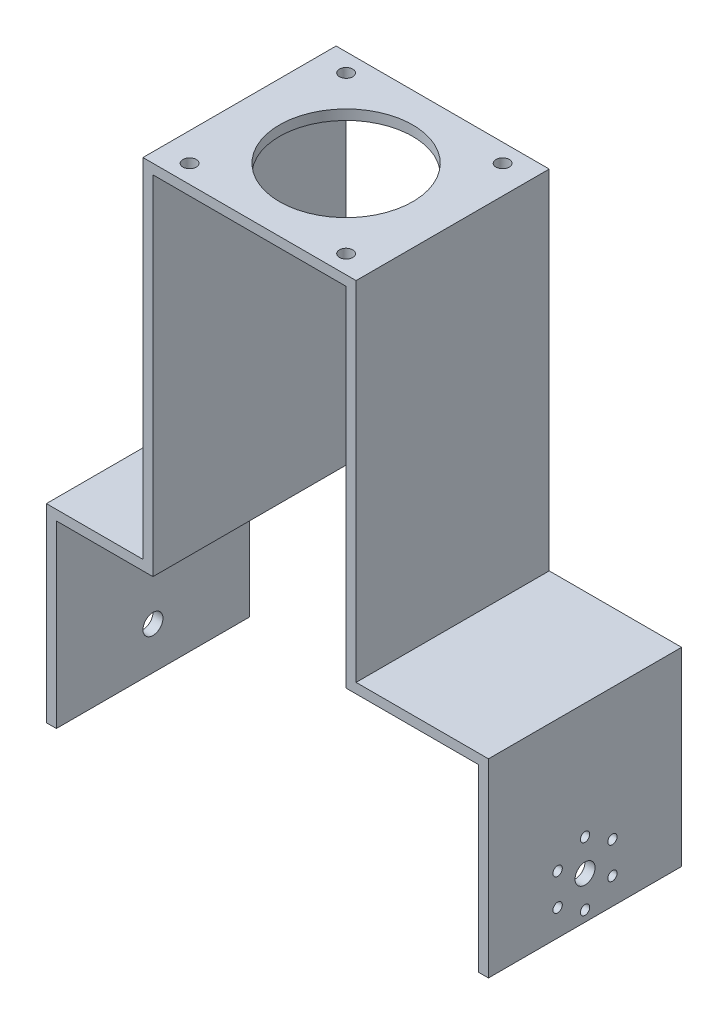
ISO-10303-21;
HEADER;
FILE_DESCRIPTION(('STEP AP214'),'2;1');
FILE_NAME('part.step','',(''),(''),'','','');
FILE_SCHEMA(('AUTOMOTIVE_DESIGN { 1 0 10303 214 1 1 1 1 }'));
ENDSEC;
DATA;
#1=APPLICATION_CONTEXT('core data for automotive mechanical design processes');
#2=APPLICATION_PROTOCOL_DEFINITION('international standard','automotive_design',2000,#1);
#3=PRODUCT_CONTEXT('',#1,'mechanical');
#4=PRODUCT('Part','Part','',(#3));
#5=PRODUCT_RELATED_PRODUCT_CATEGORY('part','',(#4));
#6=PRODUCT_DEFINITION_FORMATION('','',#4);
#7=PRODUCT_DEFINITION_CONTEXT('part definition',#1,'design');
#8=PRODUCT_DEFINITION('design','',#6,#7);
#9=PRODUCT_DEFINITION_SHAPE('','',#8);
#10=(LENGTH_UNIT() NAMED_UNIT(*) SI_UNIT(.MILLI.,.METRE.));
#11=(NAMED_UNIT(*) PLANE_ANGLE_UNIT() SI_UNIT($,.RADIAN.));
#12=(NAMED_UNIT(*) SI_UNIT($,.STERADIAN.) SOLID_ANGLE_UNIT());
#13=UNCERTAINTY_MEASURE_WITH_UNIT(LENGTH_MEASURE(1.E-05),#10,'distance_accuracy_value','');
#14=(GEOMETRIC_REPRESENTATION_CONTEXT(3) GLOBAL_UNCERTAINTY_ASSIGNED_CONTEXT((#13)) GLOBAL_UNIT_ASSIGNED_CONTEXT((#10,
#11,#12)) REPRESENTATION_CONTEXT('',''));
#15=CARTESIAN_POINT('',(0.,0.,0.));
#16=DIRECTION('',(0.,0.,1.));
#17=DIRECTION('',(1.,0.,0.));
#18=AXIS2_PLACEMENT_3D('',#15,#16,#17);
#19=CARTESIAN_POINT('',(-32.,51.8967154618484,58.));
#20=DIRECTION('',(1.,0.,0.));
#21=DIRECTION('',(0.,1.,0.));
#22=AXIS2_PLACEMENT_3D('',#19,#20,#21);
#23=PLANE('',#22);
#24=DIRECTION('',(0.,-1.,0.));
#25=VECTOR('',#24,1.);
#26=CARTESIAN_POINT('',(-32.,51.8967154618484,0.));
#27=LINE('',#26,#25);
#28=CARTESIAN_POINT('',(-32.,51.8967154618484,0.));
#29=VERTEX_POINT('',#28);
#30=CARTESIAN_POINT('',(-32.,-52.6032845381516,0.));
#31=VERTEX_POINT('',#30);
#32=EDGE_CURVE('E185',#29,#31,#27,.T.);
#33=ORIENTED_EDGE('',*,*,#32,.T.);
#34=DIRECTION('',(0.,0.,-1.));
#35=VECTOR('',#34,1.);
#36=CARTESIAN_POINT('',(-32.,-52.6032845381516,58.));
#37=LINE('',#36,#35);
#38=CARTESIAN_POINT('',(-32.,-52.6032845381516,58.));
#39=VERTEX_POINT('',#38);
#40=EDGE_CURVE('E45',#39,#31,#37,.T.);
#41=ORIENTED_EDGE('',*,*,#40,.F.);
#42=DIRECTION('',(0.,-1.,0.));
#43=VECTOR('',#42,1.);
#44=CARTESIAN_POINT('',(-32.,51.8967154618484,58.));
#45=LINE('',#44,#43);
#46=CARTESIAN_POINT('',(-32.,51.8967154618484,58.));
#47=VERTEX_POINT('',#46);
#48=EDGE_CURVE('E121',#47,#39,#45,.T.);
#49=ORIENTED_EDGE('',*,*,#48,.F.);
#50=DIRECTION('',(0.,0.,-1.));
#51=VECTOR('',#50,1.);
#52=CARTESIAN_POINT('',(-32.,51.8967154618484,58.));
#53=LINE('',#52,#51);
#54=EDGE_CURVE('E11',#47,#29,#53,.T.);
#55=ORIENTED_EDGE('',*,*,#54,.T.);
#56=EDGE_LOOP('',(#33,#41,#49,#55));
#57=FACE_BOUND('',#56,.T.);
#58=ADVANCED_FACE('F36',(#57),#23,.F.);
#59=CARTESIAN_POINT('',(-32.,-52.6032845381516,58.));
#60=DIRECTION('',(0.,-1.,0.));
#61=DIRECTION('',(1.,0.,0.));
#62=AXIS2_PLACEMENT_3D('',#59,#60,#61);
#63=PLANE('',#62);
#64=DIRECTION('',(-1.,0.,0.));
#65=VECTOR('',#64,1.);
#66=CARTESIAN_POINT('',(-32.,-52.6032845381516,0.));
#67=LINE('',#66,#65);
#68=CARTESIAN_POINT('',(-61.,-52.6032845381516,0.));
#69=VERTEX_POINT('',#68);
#70=EDGE_CURVE('E187',#31,#69,#67,.T.);
#71=ORIENTED_EDGE('',*,*,#70,.T.);
#72=DIRECTION('',(0.,0.,-1.));
#73=VECTOR('',#72,1.);
#74=CARTESIAN_POINT('',(-61.,-52.6032845381516,58.));
#75=LINE('',#74,#73);
#76=CARTESIAN_POINT('',(-61.,-52.6032845381516,58.));
#77=VERTEX_POINT('',#76);
#78=EDGE_CURVE('E246',#77,#69,#75,.T.);
#79=ORIENTED_EDGE('',*,*,#78,.F.);
#80=DIRECTION('',(-1.,0.,0.));
#81=VECTOR('',#80,1.);
#82=CARTESIAN_POINT('',(-32.,-52.6032845381516,58.));
#83=LINE('',#82,#81);
#84=EDGE_CURVE('E255',#39,#77,#83,.T.);
#85=ORIENTED_EDGE('',*,*,#84,.F.);
#86=ORIENTED_EDGE('',*,*,#40,.T.);
#87=EDGE_LOOP('',(#71,#79,#85,#86));
#88=FACE_BOUND('',#87,.T.);
#89=ADVANCED_FACE('F253',(#88),#63,.F.);
#90=CARTESIAN_POINT('',(-61.,-52.6032845381516,58.));
#91=DIRECTION('',(1.,0.,0.));
#92=DIRECTION('',(0.,0.,-1.));
#93=AXIS2_PLACEMENT_3D('',#90,#91,#92);
#94=PLANE('',#93);
#95=CARTESIAN_POINT('',(-61.,-96.9032845381516,29.));
#96=DIRECTION('',(-1.,0.,0.));
#97=DIRECTION('',(0.,0.,1.));
#98=AXIS2_PLACEMENT_3D('',#95,#96,#97);
#99=CIRCLE('',#98,3.);
#100=CARTESIAN_POINT('',(-61.,-96.9032845381516,32.));
#101=VERTEX_POINT('',#100);
#102=EDGE_CURVE('E377',#101,#101,#99,.T.);
#103=ORIENTED_EDGE('',*,*,#102,.F.);
#104=EDGE_LOOP('',(#103));
#105=FACE_BOUND('',#104,.T.);
#106=DIRECTION('',(0.,-1.,0.));
#107=VECTOR('',#106,1.);
#108=CARTESIAN_POINT('',(-61.,-52.6032845381516,0.));
#109=LINE('',#108,#107);
#110=CARTESIAN_POINT('',(-61.,-109.603284538152,0.));
#111=VERTEX_POINT('',#110);
#112=EDGE_CURVE('E190',#69,#111,#109,.T.);
#113=ORIENTED_EDGE('',*,*,#112,.T.);
#114=DIRECTION('',(0.,0.,-1.));
#115=VECTOR('',#114,1.);
#116=CARTESIAN_POINT('',(-61.,-109.603284538152,58.));
#117=LINE('',#116,#115);
#118=CARTESIAN_POINT('',(-61.,-109.603284538152,58.));
#119=VERTEX_POINT('',#118);
#120=EDGE_CURVE('E243',#119,#111,#117,.T.);
#121=ORIENTED_EDGE('',*,*,#120,.F.);
#122=DIRECTION('',(0.,-1.,0.));
#123=VECTOR('',#122,1.);
#124=CARTESIAN_POINT('',(-61.,-52.6032845381516,58.));
#125=LINE('',#124,#123);
#126=EDGE_CURVE('E274',#77,#119,#125,.T.);
#127=ORIENTED_EDGE('',*,*,#126,.F.);
#128=ORIENTED_EDGE('',*,*,#78,.T.);
#129=EDGE_LOOP('',(#113,#121,#127,#128));
#130=FACE_BOUND('',#129,.T.);
#131=ADVANCED_FACE('F265',(#105,#130),#94,.F.);
#132=CARTESIAN_POINT('',(-61.,-109.603284538152,58.));
#133=DIRECTION('',(0.,1.,0.));
#134=DIRECTION('',(0.,0.,1.));
#135=AXIS2_PLACEMENT_3D('',#132,#133,#134);
#136=PLANE('',#135);
#137=DIRECTION('',(1.,0.,0.));
#138=VECTOR('',#137,1.);
#139=CARTESIAN_POINT('',(-61.,-109.603284538152,0.));
#140=LINE('',#139,#138);
#141=CARTESIAN_POINT('',(-58.,-109.603284538152,0.));
#142=VERTEX_POINT('',#141);
#143=EDGE_CURVE('E192',#111,#142,#140,.T.);
#144=ORIENTED_EDGE('',*,*,#143,.T.);
#145=DIRECTION('',(0.,0.,-1.));
#146=VECTOR('',#145,1.);
#147=CARTESIAN_POINT('',(-58.,-109.603284538152,58.));
#148=LINE('',#147,#146);
#149=CARTESIAN_POINT('',(-58.,-109.603284538152,58.));
#150=VERTEX_POINT('',#149);
#151=EDGE_CURVE('E240',#150,#142,#148,.T.);
#152=ORIENTED_EDGE('',*,*,#151,.F.);
#153=DIRECTION('',(1.,0.,0.));
#154=VECTOR('',#153,1.);
#155=CARTESIAN_POINT('',(-61.,-109.603284538152,58.));
#156=LINE('',#155,#154);
#157=EDGE_CURVE('E271',#119,#150,#156,.T.);
#158=ORIENTED_EDGE('',*,*,#157,.F.);
#159=ORIENTED_EDGE('',*,*,#120,.T.);
#160=EDGE_LOOP('',(#144,#152,#158,#159));
#161=FACE_BOUND('',#160,.T.);
#162=ADVANCED_FACE('F269',(#161),#136,.F.);
#163=CARTESIAN_POINT('',(-58.,-55.6032845381516,58.));
#164=DIRECTION('',(-1.,0.,0.));
#165=DIRECTION('',(0.,0.,1.));
#166=AXIS2_PLACEMENT_3D('',#163,#164,#165);
#167=PLANE('',#166);
#168=CARTESIAN_POINT('',(-58.,-96.9032845381516,29.));
#169=DIRECTION('',(-1.,0.,0.));
#170=DIRECTION('',(0.,0.,1.));
#171=AXIS2_PLACEMENT_3D('',#168,#169,#170);
#172=CIRCLE('',#171,3.);
#173=CARTESIAN_POINT('',(-58.,-96.9032845381516,32.));
#174=VERTEX_POINT('',#173);
#175=EDGE_CURVE('E39',#174,#174,#172,.T.);
#176=ORIENTED_EDGE('',*,*,#175,.T.);
#177=EDGE_LOOP('',(#176));
#178=FACE_BOUND('',#177,.T.);
#179=DIRECTION('',(0.,1.,0.));
#180=VECTOR('',#179,1.);
#181=CARTESIAN_POINT('',(-58.,-55.6032845381516,0.));
#182=LINE('',#181,#180);
#183=CARTESIAN_POINT('',(-58.,-55.6032845381516,0.));
#184=VERTEX_POINT('',#183);
#185=EDGE_CURVE('E194',#142,#184,#182,.T.);
#186=ORIENTED_EDGE('',*,*,#185,.T.);
#187=DIRECTION('',(0.,0.,-1.));
#188=VECTOR('',#187,1.);
#189=CARTESIAN_POINT('',(-58.,-55.6032845381516,58.));
#190=LINE('',#189,#188);
#191=CARTESIAN_POINT('',(-58.,-55.6032845381516,58.));
#192=VERTEX_POINT('',#191);
#193=EDGE_CURVE('E237',#192,#184,#190,.T.);
#194=ORIENTED_EDGE('',*,*,#193,.F.);
#195=DIRECTION('',(0.,1.,0.));
#196=VECTOR('',#195,1.);
#197=CARTESIAN_POINT('',(-58.,-55.6032845381516,58.));
#198=LINE('',#197,#196);
#199=EDGE_CURVE('E273',#150,#192,#198,.T.);
#200=ORIENTED_EDGE('',*,*,#199,.F.);
#201=ORIENTED_EDGE('',*,*,#151,.T.);
#202=EDGE_LOOP('',(#186,#194,#200,#201));
#203=FACE_BOUND('',#202,.T.);
#204=ADVANCED_FACE('F384',(#178,#203),#167,.F.);
#205=CARTESIAN_POINT('',(-29.,-55.6032845381516,58.));
#206=DIRECTION('',(0.,1.,0.));
#207=DIRECTION('',(-1.,0.,0.));
#208=AXIS2_PLACEMENT_3D('',#205,#206,#207);
#209=PLANE('',#208);
#210=DIRECTION('',(1.,0.,0.));
#211=VECTOR('',#210,1.);
#212=CARTESIAN_POINT('',(-29.,-55.6032845381516,0.));
#213=LINE('',#212,#211);
#214=CARTESIAN_POINT('',(-29.,-55.6032845381516,0.));
#215=VERTEX_POINT('',#214);
#216=EDGE_CURVE('E196',#184,#215,#213,.T.);
#217=ORIENTED_EDGE('',*,*,#216,.T.);
#218=DIRECTION('',(0.,0.,-1.));
#219=VECTOR('',#218,1.);
#220=CARTESIAN_POINT('',(-29.,-55.6032845381516,58.));
#221=LINE('',#220,#219);
#222=CARTESIAN_POINT('',(-29.,-55.6032845381516,58.));
#223=VERTEX_POINT('',#222);
#224=EDGE_CURVE('E234',#223,#215,#221,.T.);
#225=ORIENTED_EDGE('',*,*,#224,.F.);
#226=DIRECTION('',(1.,0.,0.));
#227=VECTOR('',#226,1.);
#228=CARTESIAN_POINT('',(-29.,-55.6032845381516,58.));
#229=LINE('',#228,#227);
#230=EDGE_CURVE('E276',#192,#223,#229,.T.);
#231=ORIENTED_EDGE('',*,*,#230,.F.);
#232=ORIENTED_EDGE('',*,*,#193,.T.);
#233=EDGE_LOOP('',(#217,#225,#231,#232));
#234=FACE_BOUND('',#233,.T.);
#235=ADVANCED_FACE('F411',(#234),#209,.F.);
#236=CARTESIAN_POINT('',(-29.,48.8967154618484,58.));
#237=DIRECTION('',(-1.,0.,0.));
#238=DIRECTION('',(0.,-1.,0.));
#239=AXIS2_PLACEMENT_3D('',#236,#237,#238);
#240=PLANE('',#239);
#241=DIRECTION('',(0.,1.,0.));
#242=VECTOR('',#241,1.);
#243=CARTESIAN_POINT('',(-29.,48.8967154618484,0.));
#244=LINE('',#243,#242);
#245=CARTESIAN_POINT('',(-29.,48.8967154618484,0.));
#246=VERTEX_POINT('',#245);
#247=EDGE_CURVE('E198',#215,#246,#244,.T.);
#248=ORIENTED_EDGE('',*,*,#247,.T.);
#249=DIRECTION('',(0.,0.,-1.));
#250=VECTOR('',#249,1.);
#251=CARTESIAN_POINT('',(-29.,48.8967154618484,58.));
#252=LINE('',#251,#250);
#253=CARTESIAN_POINT('',(-29.,48.8967154618484,58.));
#254=VERTEX_POINT('',#253);
#255=EDGE_CURVE('E231',#254,#246,#252,.T.);
#256=ORIENTED_EDGE('',*,*,#255,.F.);
#257=DIRECTION('',(0.,1.,0.));
#258=VECTOR('',#257,1.);
#259=CARTESIAN_POINT('',(-29.,48.8967154618484,58.));
#260=LINE('',#259,#258);
#261=EDGE_CURVE('E282',#223,#254,#260,.T.);
#262=ORIENTED_EDGE('',*,*,#261,.F.);
#263=ORIENTED_EDGE('',*,*,#224,.T.);
#264=EDGE_LOOP('',(#248,#256,#262,#263));
#265=FACE_BOUND('',#264,.T.);
#266=ADVANCED_FACE('F414',(#265),#240,.F.);
#267=CARTESIAN_POINT('',(0.,48.8967154618484,58.));
#268=DIRECTION('',(0.,1.,0.));
#269=DIRECTION('',(0.,0.,1.));
#270=AXIS2_PLACEMENT_3D('',#267,#268,#269);
#271=PLANE('',#270);
#272=CARTESIAN_POINT('',(0.,48.8967154618484,29.));
#273=DIRECTION('',(0.,1.,0.));
#274=DIRECTION('',(0.,0.,1.));
#275=AXIS2_PLACEMENT_3D('',#272,#273,#274);
#276=CIRCLE('',#275,20.);
#277=CARTESIAN_POINT('',(0.,48.8967154618484,49.));
#278=VERTEX_POINT('',#277);
#279=EDGE_CURVE('E329',#278,#278,#276,.T.);
#280=ORIENTED_EDGE('',*,*,#279,.T.);
#281=EDGE_LOOP('',(#280));
#282=FACE_BOUND('',#281,.T.);
#283=CARTESIAN_POINT('',(-23.5,48.8967154618484,52.5));
#284=DIRECTION('',(0.,1.,0.));
#285=DIRECTION('',(0.,0.,1.));
#286=AXIS2_PLACEMENT_3D('',#283,#284,#285);
#287=CIRCLE('',#286,2.);
#288=CARTESIAN_POINT('',(-23.5,48.8967154618484,54.5));
#289=VERTEX_POINT('',#288);
#290=EDGE_CURVE('E323',#289,#289,#287,.T.);
#291=ORIENTED_EDGE('',*,*,#290,.T.);
#292=EDGE_LOOP('',(#291));
#293=FACE_BOUND('',#292,.T.);
#294=CARTESIAN_POINT('',(23.5,48.8967154618484,52.5));
#295=DIRECTION('',(0.,1.,0.));
#296=DIRECTION('',(0.,0.,1.));
#297=AXIS2_PLACEMENT_3D('',#294,#295,#296);
#298=CIRCLE('',#297,2.);
#299=CARTESIAN_POINT('',(23.5,48.8967154618484,54.5));
#300=VERTEX_POINT('',#299);
#301=EDGE_CURVE('E317',#300,#300,#298,.T.);
#302=ORIENTED_EDGE('',*,*,#301,.T.);
#303=EDGE_LOOP('',(#302));
#304=FACE_BOUND('',#303,.T.);
#305=CARTESIAN_POINT('',(23.5,48.8967154618484,5.5));
#306=DIRECTION('',(0.,1.,0.));
#307=DIRECTION('',(0.,0.,1.));
#308=AXIS2_PLACEMENT_3D('',#305,#306,#307);
#309=CIRCLE('',#308,2.);
#310=CARTESIAN_POINT('',(23.5,48.8967154618484,7.5));
#311=VERTEX_POINT('',#310);
#312=EDGE_CURVE('E311',#311,#311,#309,.T.);
#313=ORIENTED_EDGE('',*,*,#312,.T.);
#314=EDGE_LOOP('',(#313));
#315=FACE_BOUND('',#314,.T.);
#316=CARTESIAN_POINT('',(-23.5,48.8967154618484,5.5));
#317=DIRECTION('',(0.,1.,0.));
#318=DIRECTION('',(0.,0.,1.));
#319=AXIS2_PLACEMENT_3D('',#316,#317,#318);
#320=CIRCLE('',#319,2.);
#321=CARTESIAN_POINT('',(-23.5,48.8967154618484,7.5));
#322=VERTEX_POINT('',#321);
#323=EDGE_CURVE('E188',#322,#322,#320,.T.);
#324=ORIENTED_EDGE('',*,*,#323,.T.);
#325=EDGE_LOOP('',(#324));
#326=FACE_BOUND('',#325,.T.);
#327=DIRECTION('',(1.,0.,0.));
#328=VECTOR('',#327,1.);
#329=CARTESIAN_POINT('',(0.,48.8967154618484,0.));
#330=LINE('',#329,#328);
#331=CARTESIAN_POINT('',(29.,48.8967154618484,0.));
#332=VERTEX_POINT('',#331);
#333=EDGE_CURVE('E201',#246,#332,#330,.T.);
#334=ORIENTED_EDGE('',*,*,#333,.T.);
#335=DIRECTION('',(0.,0.,-1.));
#336=VECTOR('',#335,1.);
#337=CARTESIAN_POINT('',(29.,48.8967154618484,58.));
#338=LINE('',#337,#336);
#339=CARTESIAN_POINT('',(29.,48.8967154618484,58.));
#340=VERTEX_POINT('',#339);
#341=EDGE_CURVE('E228',#340,#332,#338,.T.);
#342=ORIENTED_EDGE('',*,*,#341,.F.);
#343=DIRECTION('',(1.,0.,0.));
#344=VECTOR('',#343,1.);
#345=CARTESIAN_POINT('',(0.,48.8967154618484,58.));
#346=LINE('',#345,#344);
#347=EDGE_CURVE('E284',#254,#340,#346,.T.);
#348=ORIENTED_EDGE('',*,*,#347,.F.);
#349=ORIENTED_EDGE('',*,*,#255,.T.);
#350=EDGE_LOOP('',(#334,#342,#348,#349));
#351=FACE_BOUND('',#350,.T.);
#352=ADVANCED_FACE('F418',(#282,#293,#304,#315,#326,#351),#271,.F.);
#353=CARTESIAN_POINT('',(29.,48.8967154618484,58.));
#354=DIRECTION('',(1.,0.,0.));
#355=DIRECTION('',(0.,1.,0.));
#356=AXIS2_PLACEMENT_3D('',#353,#354,#355);
#357=PLANE('',#356);
#358=DIRECTION('',(0.,-1.,0.));
#359=VECTOR('',#358,1.);
#360=CARTESIAN_POINT('',(29.,48.8967154618484,0.));
#361=LINE('',#360,#359);
#362=CARTESIAN_POINT('',(29.,-55.6032845381516,0.));
#363=VERTEX_POINT('',#362);
#364=EDGE_CURVE('E203',#332,#363,#361,.T.);
#365=ORIENTED_EDGE('',*,*,#364,.T.);
#366=DIRECTION('',(0.,0.,-1.));
#367=VECTOR('',#366,1.);
#368=CARTESIAN_POINT('',(29.,-55.6032845381516,58.));
#369=LINE('',#368,#367);
#370=CARTESIAN_POINT('',(29.,-55.6032845381516,58.));
#371=VERTEX_POINT('',#370);
#372=EDGE_CURVE('E225',#371,#363,#369,.T.);
#373=ORIENTED_EDGE('',*,*,#372,.F.);
#374=DIRECTION('',(0.,-1.,0.));
#375=VECTOR('',#374,1.);
#376=CARTESIAN_POINT('',(29.,48.8967154618484,58.));
#377=LINE('',#376,#375);
#378=EDGE_CURVE('E286',#340,#371,#377,.T.);
#379=ORIENTED_EDGE('',*,*,#378,.F.);
#380=ORIENTED_EDGE('',*,*,#341,.T.);
#381=EDGE_LOOP('',(#365,#373,#379,#380));
#382=FACE_BOUND('',#381,.T.);
#383=ADVANCED_FACE('F422',(#382),#357,.F.);
#384=CARTESIAN_POINT('',(29.,-55.6032845381516,58.));
#385=DIRECTION('',(0.,1.,0.));
#386=DIRECTION('',(0.,0.,1.));
#387=AXIS2_PLACEMENT_3D('',#384,#385,#386);
#388=PLANE('',#387);
#389=DIRECTION('',(1.,0.,0.));
#390=VECTOR('',#389,1.);
#391=CARTESIAN_POINT('',(29.,-55.6032845381516,0.));
#392=LINE('',#391,#390);
#393=CARTESIAN_POINT('',(68.75,-55.6032845381516,0.));
#394=VERTEX_POINT('',#393);
#395=EDGE_CURVE('E205',#363,#394,#392,.T.);
#396=ORIENTED_EDGE('',*,*,#395,.T.);
#397=DIRECTION('',(0.,0.,-1.));
#398=VECTOR('',#397,1.);
#399=CARTESIAN_POINT('',(68.75,-55.6032845381516,58.));
#400=LINE('',#399,#398);
#401=CARTESIAN_POINT('',(68.75,-55.6032845381516,58.));
#402=VERTEX_POINT('',#401);
#403=EDGE_CURVE('E222',#402,#394,#400,.T.);
#404=ORIENTED_EDGE('',*,*,#403,.F.);
#405=DIRECTION('',(1.,0.,0.));
#406=VECTOR('',#405,1.);
#407=CARTESIAN_POINT('',(29.,-55.6032845381516,58.));
#408=LINE('',#407,#406);
#409=EDGE_CURVE('E288',#371,#402,#408,.T.);
#410=ORIENTED_EDGE('',*,*,#409,.F.);
#411=ORIENTED_EDGE('',*,*,#372,.T.);
#412=EDGE_LOOP('',(#396,#404,#410,#411));
#413=FACE_BOUND('',#412,.T.);
#414=ADVANCED_FACE('F426',(#413),#388,.F.);
#415=CARTESIAN_POINT('',(68.75,-55.6032845381516,58.));
#416=DIRECTION('',(1.,0.,0.));
#417=DIRECTION('',(0.,1.,0.));
#418=AXIS2_PLACEMENT_3D('',#415,#416,#417);
#419=PLANE('',#418);
#420=CARTESIAN_POINT('',(68.75,-92.1532845381519,37.2272413359519));
#421=DIRECTION('',(1.,0.,0.));
#422=DIRECTION('',(0.,1.,0.));
#423=AXIS2_PLACEMENT_3D('',#420,#421,#422);
#424=CIRCLE('',#423,1.4);
#425=CARTESIAN_POINT('',(68.75,-90.7532845381519,37.2272413359519));
#426=VERTEX_POINT('',#425);
#427=EDGE_CURVE('E371',#426,#426,#424,.T.);
#428=ORIENTED_EDGE('',*,*,#427,.T.);
#429=EDGE_LOOP('',(#428));
#430=FACE_BOUND('',#429,.T.);
#431=CARTESIAN_POINT('',(68.75,-101.653284538152,37.2272413359515));
#432=DIRECTION('',(1.,0.,0.));
#433=DIRECTION('',(0.,1.,0.));
#434=AXIS2_PLACEMENT_3D('',#431,#432,#433);
#435=CIRCLE('',#434,1.40000000000001);
#436=CARTESIAN_POINT('',(68.75,-100.253284538152,37.2272413359515));
#437=VERTEX_POINT('',#436);
#438=EDGE_CURVE('E365',#437,#437,#435,.T.);
#439=ORIENTED_EDGE('',*,*,#438,.T.);
#440=EDGE_LOOP('',(#439));
#441=FACE_BOUND('',#440,.T.);
#442=CARTESIAN_POINT('',(68.75,-106.403284538152,28.9999999999991));
#443=DIRECTION('',(1.,0.,0.));
#444=DIRECTION('',(0.,1.,0.));
#445=AXIS2_PLACEMENT_3D('',#442,#443,#444);
#446=CIRCLE('',#445,1.4);
#447=CARTESIAN_POINT('',(68.75,-105.003284538152,28.9999999999991));
#448=VERTEX_POINT('',#447);
#449=EDGE_CURVE('E359',#448,#448,#446,.T.);
#450=ORIENTED_EDGE('',*,*,#449,.T.);
#451=EDGE_LOOP('',(#450));
#452=FACE_BOUND('',#451,.T.);
#453=CARTESIAN_POINT('',(68.75,-101.653284538151,20.7727586640471));
#454=DIRECTION('',(1.,0.,0.));
#455=DIRECTION('',(0.,1.,0.));
#456=AXIS2_PLACEMENT_3D('',#453,#454,#455);
#457=CIRCLE('',#456,1.39999999999999);
#458=CARTESIAN_POINT('',(68.75,-100.253284538151,20.7727586640471));
#459=VERTEX_POINT('',#458);
#460=EDGE_CURVE('E353',#459,#459,#457,.T.);
#461=ORIENTED_EDGE('',*,*,#460,.T.);
#462=EDGE_LOOP('',(#461));
#463=FACE_BOUND('',#462,.T.);
#464=CARTESIAN_POINT('',(68.75,-92.1532845381511,20.7727586640476));
#465=DIRECTION('',(1.,0.,0.));
#466=DIRECTION('',(0.,1.,0.));
#467=AXIS2_PLACEMENT_3D('',#464,#465,#466);
#468=CIRCLE('',#467,1.4);
#469=CARTESIAN_POINT('',(68.75,-90.7532845381511,20.7727586640476));
#470=VERTEX_POINT('',#469);
#471=EDGE_CURVE('E347',#470,#470,#468,.T.);
#472=ORIENTED_EDGE('',*,*,#471,.T.);
#473=EDGE_LOOP('',(#472));
#474=FACE_BOUND('',#473,.T.);
#475=CARTESIAN_POINT('',(68.75,-87.4032845381515,29.));
#476=DIRECTION('',(1.,0.,0.));
#477=DIRECTION('',(0.,1.,0.));
#478=AXIS2_PLACEMENT_3D('',#475,#476,#477);
#479=CIRCLE('',#478,1.4);
#480=CARTESIAN_POINT('',(68.75,-86.0032845381515,29.));
#481=VERTEX_POINT('',#480);
#482=EDGE_CURVE('E341',#481,#481,#479,.T.);
#483=ORIENTED_EDGE('',*,*,#482,.T.);
#484=EDGE_LOOP('',(#483));
#485=FACE_BOUND('',#484,.T.);
#486=CARTESIAN_POINT('',(68.75,-96.9032845381516,29.));
#487=DIRECTION('',(1.,0.,0.));
#488=DIRECTION('',(0.,1.,0.));
#489=AXIS2_PLACEMENT_3D('',#486,#487,#488);
#490=CIRCLE('',#489,3.);
#491=CARTESIAN_POINT('',(68.75,-93.9032845381516,29.));
#492=VERTEX_POINT('',#491);
#493=EDGE_CURVE('E335',#492,#492,#490,.T.);
#494=ORIENTED_EDGE('',*,*,#493,.T.);
#495=EDGE_LOOP('',(#494));
#496=FACE_BOUND('',#495,.T.);
#497=DIRECTION('',(0.,-1.,0.));
#498=VECTOR('',#497,1.);
#499=CARTESIAN_POINT('',(68.75,-55.6032845381516,0.));
#500=LINE('',#499,#498);
#501=CARTESIAN_POINT('',(68.75,-109.603284538152,0.));
#502=VERTEX_POINT('',#501);
#503=EDGE_CURVE('E207',#394,#502,#500,.T.);
#504=ORIENTED_EDGE('',*,*,#503,.T.);
#505=DIRECTION('',(0.,0.,-1.));
#506=VECTOR('',#505,1.);
#507=CARTESIAN_POINT('',(68.75,-109.603284538152,58.));
#508=LINE('',#507,#506);
#509=CARTESIAN_POINT('',(68.75,-109.603284538152,58.));
#510=VERTEX_POINT('',#509);
#511=EDGE_CURVE('E219',#510,#502,#508,.T.);
#512=ORIENTED_EDGE('',*,*,#511,.F.);
#513=DIRECTION('',(0.,-1.,0.));
#514=VECTOR('',#513,1.);
#515=CARTESIAN_POINT('',(68.75,-55.6032845381516,58.));
#516=LINE('',#515,#514);
#517=EDGE_CURVE('E290',#402,#510,#516,.T.);
#518=ORIENTED_EDGE('',*,*,#517,.F.);
#519=ORIENTED_EDGE('',*,*,#403,.T.);
#520=EDGE_LOOP('',(#504,#512,#518,#519));
#521=FACE_BOUND('',#520,.T.);
#522=ADVANCED_FACE('F296',(#430,#441,#452,#463,#474,#485,#496,#521),#419,.F.);
#523=CARTESIAN_POINT('',(68.75,-109.603284538152,58.));
#524=DIRECTION('',(0.,1.,0.));
#525=DIRECTION('',(0.,0.,1.));
#526=AXIS2_PLACEMENT_3D('',#523,#524,#525);
#527=PLANE('',#526);
#528=DIRECTION('',(1.,0.,0.));
#529=VECTOR('',#528,1.);
#530=CARTESIAN_POINT('',(68.75,-109.603284538152,0.));
#531=LINE('',#530,#529);
#532=CARTESIAN_POINT('',(71.75,-109.603284538152,0.));
#533=VERTEX_POINT('',#532);
#534=EDGE_CURVE('E209',#502,#533,#531,.T.);
#535=ORIENTED_EDGE('',*,*,#534,.T.);
#536=DIRECTION('',(0.,0.,-1.));
#537=VECTOR('',#536,1.);
#538=CARTESIAN_POINT('',(71.75,-109.603284538152,58.));
#539=LINE('',#538,#537);
#540=CARTESIAN_POINT('',(71.75,-109.603284538152,58.));
#541=VERTEX_POINT('',#540);
#542=EDGE_CURVE('E174',#541,#533,#539,.T.);
#543=ORIENTED_EDGE('',*,*,#542,.F.);
#544=DIRECTION('',(1.,0.,0.));
#545=VECTOR('',#544,1.);
#546=CARTESIAN_POINT('',(68.75,-109.603284538152,58.));
#547=LINE('',#546,#545);
#548=EDGE_CURVE('E165',#510,#541,#547,.T.);
#549=ORIENTED_EDGE('',*,*,#548,.F.);
#550=ORIENTED_EDGE('',*,*,#511,.T.);
#551=EDGE_LOOP('',(#535,#543,#549,#550));
#552=FACE_BOUND('',#551,.T.);
#553=ADVANCED_FACE('F300',(#552),#527,.F.);
#554=CARTESIAN_POINT('',(71.75,-52.6032845381516,58.));
#555=DIRECTION('',(-1.,0.,0.));
#556=DIRECTION('',(0.,-1.,0.));
#557=AXIS2_PLACEMENT_3D('',#554,#555,#556);
#558=PLANE('',#557);
#559=CARTESIAN_POINT('',(71.7499999999999,-92.1532845381519,37.2272413359519));
#560=DIRECTION('',(1.,0.,0.));
#561=DIRECTION('',(0.,0.,-1.));
#562=AXIS2_PLACEMENT_3D('',#559,#560,#561);
#563=CIRCLE('',#562,1.4);
#564=CARTESIAN_POINT('',(71.7499999999999,-92.1532845381519,35.8272413359519));
#565=VERTEX_POINT('',#564);
#566=EDGE_CURVE('E374',#565,#565,#563,.T.);
#567=ORIENTED_EDGE('',*,*,#566,.F.);
#568=EDGE_LOOP('',(#567));
#569=FACE_BOUND('',#568,.T.);
#570=CARTESIAN_POINT('',(71.7499999999999,-101.653284538152,37.2272413359515));
#571=DIRECTION('',(1.,0.,0.));
#572=DIRECTION('',(0.,0.,-1.));
#573=AXIS2_PLACEMENT_3D('',#570,#571,#572);
#574=CIRCLE('',#573,1.40000000000001);
#575=CARTESIAN_POINT('',(71.7499999999999,-101.653284538152,35.8272413359514));
#576=VERTEX_POINT('',#575);
#577=EDGE_CURVE('E368',#576,#576,#574,.T.);
#578=ORIENTED_EDGE('',*,*,#577,.F.);
#579=EDGE_LOOP('',(#578));
#580=FACE_BOUND('',#579,.T.);
#581=CARTESIAN_POINT('',(71.7499999999999,-106.403284538152,28.9999999999991));
#582=DIRECTION('',(1.,0.,0.));
#583=DIRECTION('',(0.,0.,-1.));
#584=AXIS2_PLACEMENT_3D('',#581,#582,#583);
#585=CIRCLE('',#584,1.4);
#586=CARTESIAN_POINT('',(71.7499999999999,-106.403284538152,27.5999999999991));
#587=VERTEX_POINT('',#586);
#588=EDGE_CURVE('E362',#587,#587,#585,.T.);
#589=ORIENTED_EDGE('',*,*,#588,.F.);
#590=EDGE_LOOP('',(#589));
#591=FACE_BOUND('',#590,.T.);
#592=CARTESIAN_POINT('',(71.7499999999999,-101.653284538151,20.7727586640471));
#593=DIRECTION('',(1.,0.,0.));
#594=DIRECTION('',(0.,0.,-1.));
#595=AXIS2_PLACEMENT_3D('',#592,#593,#594);
#596=CIRCLE('',#595,1.39999999999999);
#597=CARTESIAN_POINT('',(71.7499999999999,-101.653284538151,19.3727586640471));
#598=VERTEX_POINT('',#597);
#599=EDGE_CURVE('E356',#598,#598,#596,.T.);
#600=ORIENTED_EDGE('',*,*,#599,.F.);
#601=EDGE_LOOP('',(#600));
#602=FACE_BOUND('',#601,.T.);
#603=CARTESIAN_POINT('',(71.7499999999999,-92.1532845381511,20.7727586640476));
#604=DIRECTION('',(1.,0.,0.));
#605=DIRECTION('',(0.,0.,-1.));
#606=AXIS2_PLACEMENT_3D('',#603,#604,#605);
#607=CIRCLE('',#606,1.4);
#608=CARTESIAN_POINT('',(71.7499999999999,-92.1532845381511,19.3727586640476));
#609=VERTEX_POINT('',#608);
#610=EDGE_CURVE('E350',#609,#609,#607,.T.);
#611=ORIENTED_EDGE('',*,*,#610,.F.);
#612=EDGE_LOOP('',(#611));
#613=FACE_BOUND('',#612,.T.);
#614=CARTESIAN_POINT('',(71.7499999999999,-87.4032845381515,29.));
#615=DIRECTION('',(1.,0.,0.));
#616=DIRECTION('',(0.,0.,-1.));
#617=AXIS2_PLACEMENT_3D('',#614,#615,#616);
#618=CIRCLE('',#617,1.4);
#619=CARTESIAN_POINT('',(71.7499999999999,-87.4032845381515,27.6));
#620=VERTEX_POINT('',#619);
#621=EDGE_CURVE('E344',#620,#620,#618,.T.);
#622=ORIENTED_EDGE('',*,*,#621,.F.);
#623=EDGE_LOOP('',(#622));
#624=FACE_BOUND('',#623,.T.);
#625=CARTESIAN_POINT('',(71.7499999999999,-96.9032845381516,29.));
#626=DIRECTION('',(1.,0.,0.));
#627=DIRECTION('',(0.,0.,-1.));
#628=AXIS2_PLACEMENT_3D('',#625,#626,#627);
#629=CIRCLE('',#628,3.);
#630=CARTESIAN_POINT('',(71.7499999999999,-96.9032845381516,26.));
#631=VERTEX_POINT('',#630);
#632=EDGE_CURVE('E338',#631,#631,#629,.T.);
#633=ORIENTED_EDGE('',*,*,#632,.F.);
#634=EDGE_LOOP('',(#633));
#635=FACE_BOUND('',#634,.T.);
#636=DIRECTION('',(0.,1.,0.));
#637=VECTOR('',#636,1.);
#638=CARTESIAN_POINT('',(71.75,-52.6032845381516,0.));
#639=LINE('',#638,#637);
#640=CARTESIAN_POINT('',(71.75,-52.6032845381516,0.));
#641=VERTEX_POINT('',#640);
#642=EDGE_CURVE('E173',#533,#641,#639,.T.);
#643=ORIENTED_EDGE('',*,*,#642,.T.);
#644=DIRECTION('',(0.,0.,-1.));
#645=VECTOR('',#644,1.);
#646=CARTESIAN_POINT('',(71.75,-52.6032845381516,58.));
#647=LINE('',#646,#645);
#648=CARTESIAN_POINT('',(71.75,-52.6032845381516,58.));
#649=VERTEX_POINT('',#648);
#650=EDGE_CURVE('E170',#649,#641,#647,.T.);
#651=ORIENTED_EDGE('',*,*,#650,.F.);
#652=DIRECTION('',(0.,1.,0.));
#653=VECTOR('',#652,1.);
#654=CARTESIAN_POINT('',(71.75,-52.6032845381516,58.));
#655=LINE('',#654,#653);
#656=EDGE_CURVE('E159',#541,#649,#655,.T.);
#657=ORIENTED_EDGE('',*,*,#656,.F.);
#658=ORIENTED_EDGE('',*,*,#542,.T.);
#659=EDGE_LOOP('',(#643,#651,#657,#658));
#660=FACE_BOUND('',#659,.T.);
#661=ADVANCED_FACE('F171',(#569,#580,#591,#602,#613,#624,#635,#660),#558,.F.);
#662=CARTESIAN_POINT('',(32.,-52.6032845381516,58.));
#663=DIRECTION('',(0.,-1.,0.));
#664=DIRECTION('',(1.,0.,0.));
#665=AXIS2_PLACEMENT_3D('',#662,#663,#664);
#666=PLANE('',#665);
#667=DIRECTION('',(-1.,0.,0.));
#668=VECTOR('',#667,1.);
#669=CARTESIAN_POINT('',(32.,-52.6032845381516,0.));
#670=LINE('',#669,#668);
#671=CARTESIAN_POINT('',(32.,-52.6032845381516,0.));
#672=VERTEX_POINT('',#671);
#673=EDGE_CURVE('E107',#641,#672,#670,.T.);
#674=ORIENTED_EDGE('',*,*,#673,.T.);
#675=DIRECTION('',(0.,0.,-1.));
#676=VECTOR('',#675,1.);
#677=CARTESIAN_POINT('',(32.,-52.6032845381516,58.));
#678=LINE('',#677,#676);
#679=CARTESIAN_POINT('',(32.,-52.6032845381516,58.));
#680=VERTEX_POINT('',#679);
#681=EDGE_CURVE('E175',#680,#672,#678,.T.);
#682=ORIENTED_EDGE('',*,*,#681,.F.);
#683=DIRECTION('',(-1.,0.,0.));
#684=VECTOR('',#683,1.);
#685=CARTESIAN_POINT('',(32.,-52.6032845381516,58.));
#686=LINE('',#685,#684);
#687=EDGE_CURVE('E163',#649,#680,#686,.T.);
#688=ORIENTED_EDGE('',*,*,#687,.F.);
#689=ORIENTED_EDGE('',*,*,#650,.T.);
#690=EDGE_LOOP('',(#674,#682,#688,#689));
#691=FACE_BOUND('',#690,.T.);
#692=ADVANCED_FACE('F177',(#691),#666,.F.);
#693=CARTESIAN_POINT('',(32.,51.8967154618484,58.));
#694=DIRECTION('',(-1.,0.,0.));
#695=DIRECTION('',(0.,-1.,0.));
#696=AXIS2_PLACEMENT_3D('',#693,#694,#695);
#697=PLANE('',#696);
#698=DIRECTION('',(0.,1.,0.));
#699=VECTOR('',#698,1.);
#700=CARTESIAN_POINT('',(32.,51.8967154618484,0.));
#701=LINE('',#700,#699);
#702=CARTESIAN_POINT('',(32.,51.8967154618484,0.));
#703=VERTEX_POINT('',#702);
#704=EDGE_CURVE('E114',#672,#703,#701,.T.);
#705=ORIENTED_EDGE('',*,*,#704,.T.);
#706=DIRECTION('',(0.,0.,-1.));
#707=VECTOR('',#706,1.);
#708=CARTESIAN_POINT('',(32.,51.8967154618484,58.));
#709=LINE('',#708,#707);
#710=CARTESIAN_POINT('',(32.,51.8967154618484,58.));
#711=VERTEX_POINT('',#710);
#712=EDGE_CURVE('E181',#711,#703,#709,.T.);
#713=ORIENTED_EDGE('',*,*,#712,.F.);
#714=DIRECTION('',(0.,1.,0.));
#715=VECTOR('',#714,1.);
#716=CARTESIAN_POINT('',(32.,51.8967154618484,58.));
#717=LINE('',#716,#715);
#718=EDGE_CURVE('E179',#680,#711,#717,.T.);
#719=ORIENTED_EDGE('',*,*,#718,.F.);
#720=ORIENTED_EDGE('',*,*,#681,.T.);
#721=EDGE_LOOP('',(#705,#713,#719,#720));
#722=FACE_BOUND('',#721,.T.);
#723=ADVANCED_FACE('F302',(#722),#697,.F.);
#724=CARTESIAN_POINT('',(0.,51.8967154618484,58.));
#725=DIRECTION('',(0.,-1.,0.));
#726=DIRECTION('',(1.,0.,0.));
#727=AXIS2_PLACEMENT_3D('',#724,#725,#726);
#728=PLANE('',#727);
#729=CARTESIAN_POINT('',(0.,51.8967154618484,29.));
#730=DIRECTION('',(0.,1.,0.));
#731=DIRECTION('',(0.,0.,1.));
#732=AXIS2_PLACEMENT_3D('',#729,#730,#731);
#733=CIRCLE('',#732,20.);
#734=CARTESIAN_POINT('',(0.,51.8967154618484,49.));
#735=VERTEX_POINT('',#734);
#736=EDGE_CURVE('E332',#735,#735,#733,.T.);
#737=ORIENTED_EDGE('',*,*,#736,.F.);
#738=EDGE_LOOP('',(#737));
#739=FACE_BOUND('',#738,.T.);
#740=CARTESIAN_POINT('',(-23.5,51.8967154618484,52.5));
#741=DIRECTION('',(0.,1.,0.));
#742=DIRECTION('',(0.,0.,-1.));
#743=AXIS2_PLACEMENT_3D('',#740,#741,#742);
#744=CIRCLE('',#743,2.);
#745=CARTESIAN_POINT('',(-23.5,51.8967154618484,50.5));
#746=VERTEX_POINT('',#745);
#747=EDGE_CURVE('E326',#746,#746,#744,.T.);
#748=ORIENTED_EDGE('',*,*,#747,.F.);
#749=EDGE_LOOP('',(#748));
#750=FACE_BOUND('',#749,.T.);
#751=CARTESIAN_POINT('',(23.5,51.8967154618484,52.5));
#752=DIRECTION('',(0.,1.,0.));
#753=DIRECTION('',(0.,0.,1.));
#754=AXIS2_PLACEMENT_3D('',#751,#752,#753);
#755=CIRCLE('',#754,2.);
#756=CARTESIAN_POINT('',(23.5,51.8967154618484,54.5));
#757=VERTEX_POINT('',#756);
#758=EDGE_CURVE('E320',#757,#757,#755,.T.);
#759=ORIENTED_EDGE('',*,*,#758,.F.);
#760=EDGE_LOOP('',(#759));
#761=FACE_BOUND('',#760,.T.);
#762=CARTESIAN_POINT('',(23.5,51.8967154618484,5.5));
#763=DIRECTION('',(0.,1.,0.));
#764=DIRECTION('',(0.,0.,-1.));
#765=AXIS2_PLACEMENT_3D('',#762,#763,#764);
#766=CIRCLE('',#765,2.);
#767=CARTESIAN_POINT('',(23.5,51.8967154618484,3.5));
#768=VERTEX_POINT('',#767);
#769=EDGE_CURVE('E314',#768,#768,#766,.T.);
#770=ORIENTED_EDGE('',*,*,#769,.F.);
#771=EDGE_LOOP('',(#770));
#772=FACE_BOUND('',#771,.T.);
#773=CARTESIAN_POINT('',(-23.5,51.8967154618484,5.5));
#774=DIRECTION('',(0.,1.,0.));
#775=DIRECTION('',(0.,0.,1.));
#776=AXIS2_PLACEMENT_3D('',#773,#774,#775);
#777=CIRCLE('',#776,2.);
#778=CARTESIAN_POINT('',(-23.5,51.8967154618484,7.5));
#779=VERTEX_POINT('',#778);
#780=EDGE_CURVE('E308',#779,#779,#777,.T.);
#781=ORIENTED_EDGE('',*,*,#780,.F.);
#782=EDGE_LOOP('',(#781));
#783=FACE_BOUND('',#782,.T.);
#784=DIRECTION('',(-1.,0.,0.));
#785=VECTOR('',#784,1.);
#786=CARTESIAN_POINT('',(0.,51.8967154618484,0.));
#787=LINE('',#786,#785);
#788=EDGE_CURVE('E214',#703,#29,#787,.T.);
#789=ORIENTED_EDGE('',*,*,#788,.T.);
#790=ORIENTED_EDGE('',*,*,#54,.F.);
#791=DIRECTION('',(-1.,0.,0.));
#792=VECTOR('',#791,1.);
#793=CARTESIAN_POINT('',(0.,51.8967154618484,58.));
#794=LINE('',#793,#792);
#795=EDGE_CURVE('E53',#711,#47,#794,.T.);
#796=ORIENTED_EDGE('',*,*,#795,.F.);
#797=ORIENTED_EDGE('',*,*,#712,.T.);
#798=EDGE_LOOP('',(#789,#790,#796,#797));
#799=FACE_BOUND('',#798,.T.);
#800=ADVANCED_FACE('F301',(#739,#750,#761,#772,#783,#799),#728,.F.);
#801=CARTESIAN_POINT('',(0.,0.,58.));
#802=DIRECTION('',(0.,0.,1.));
#803=DIRECTION('',(1.,0.,0.));
#804=AXIS2_PLACEMENT_3D('',#801,#802,#803);
#805=PLANE('',#804);
#806=ORIENTED_EDGE('',*,*,#795,.T.);
#807=ORIENTED_EDGE('',*,*,#48,.T.);
#808=ORIENTED_EDGE('',*,*,#84,.T.);
#809=ORIENTED_EDGE('',*,*,#126,.T.);
#810=ORIENTED_EDGE('',*,*,#157,.T.);
#811=ORIENTED_EDGE('',*,*,#199,.T.);
#812=ORIENTED_EDGE('',*,*,#230,.T.);
#813=ORIENTED_EDGE('',*,*,#261,.T.);
#814=ORIENTED_EDGE('',*,*,#347,.T.);
#815=ORIENTED_EDGE('',*,*,#378,.T.);
#816=ORIENTED_EDGE('',*,*,#409,.T.);
#817=ORIENTED_EDGE('',*,*,#517,.T.);
#818=ORIENTED_EDGE('',*,*,#548,.T.);
#819=ORIENTED_EDGE('',*,*,#656,.T.);
#820=ORIENTED_EDGE('',*,*,#687,.T.);
#821=ORIENTED_EDGE('',*,*,#718,.T.);
#822=EDGE_LOOP('',(#806,#807,#808,#809,#810,#811,#812,#813,#814,#815,#816,#817,#818,#819,#820,#821));
#823=FACE_BOUND('',#822,.T.);
#824=ADVANCED_FACE('F161',(#823),#805,.T.);
#825=CARTESIAN_POINT('',(0.,0.,0.));
#826=DIRECTION('',(0.,0.,1.));
#827=DIRECTION('',(1.,0.,0.));
#828=AXIS2_PLACEMENT_3D('',#825,#826,#827);
#829=PLANE('',#828);
#830=ORIENTED_EDGE('',*,*,#32,.F.);
#831=ORIENTED_EDGE('',*,*,#788,.F.);
#832=ORIENTED_EDGE('',*,*,#704,.F.);
#833=ORIENTED_EDGE('',*,*,#673,.F.);
#834=ORIENTED_EDGE('',*,*,#642,.F.);
#835=ORIENTED_EDGE('',*,*,#534,.F.);
#836=ORIENTED_EDGE('',*,*,#503,.F.);
#837=ORIENTED_EDGE('',*,*,#395,.F.);
#838=ORIENTED_EDGE('',*,*,#364,.F.);
#839=ORIENTED_EDGE('',*,*,#333,.F.);
#840=ORIENTED_EDGE('',*,*,#247,.F.);
#841=ORIENTED_EDGE('',*,*,#216,.F.);
#842=ORIENTED_EDGE('',*,*,#185,.F.);
#843=ORIENTED_EDGE('',*,*,#143,.F.);
#844=ORIENTED_EDGE('',*,*,#112,.F.);
#845=ORIENTED_EDGE('',*,*,#70,.F.);
#846=EDGE_LOOP('',(#830,#831,#832,#833,#834,#835,#836,#837,#838,#839,#840,#841,#842,#843,#844,#845));
#847=FACE_BOUND('',#846,.T.);
#848=ADVANCED_FACE('F259',(#847),#829,.F.);
#849=CARTESIAN_POINT('',(-23.5,-6.10328453815159,5.5));
#850=DIRECTION('',(0.,1.,0.));
#851=DIRECTION('',(0.,0.,1.));
#852=AXIS2_PLACEMENT_3D('',#849,#850,#851);
#853=CYLINDRICAL_SURFACE('',#852,2.);
#854=ORIENTED_EDGE('',*,*,#780,.T.);
#855=EDGE_LOOP('',(#854));
#856=FACE_BOUND('',#855,.T.);
#857=ORIENTED_EDGE('',*,*,#323,.F.);
#858=EDGE_LOOP('',(#857));
#859=FACE_BOUND('',#858,.T.);
#860=ADVANCED_FACE('F448',(#856,#859),#853,.F.);
#861=CARTESIAN_POINT('',(23.5,-6.10328453815159,5.5));
#862=DIRECTION('',(0.,1.,0.));
#863=DIRECTION('',(0.,0.,1.));
#864=AXIS2_PLACEMENT_3D('',#861,#862,#863);
#865=CYLINDRICAL_SURFACE('',#864,2.);
#866=ORIENTED_EDGE('',*,*,#769,.T.);
#867=EDGE_LOOP('',(#866));
#868=FACE_BOUND('',#867,.T.);
#869=ORIENTED_EDGE('',*,*,#312,.F.);
#870=EDGE_LOOP('',(#869));
#871=FACE_BOUND('',#870,.T.);
#872=ADVANCED_FACE('F453',(#868,#871),#865,.F.);
#873=CARTESIAN_POINT('',(23.5,-6.10328453815159,52.5));
#874=DIRECTION('',(0.,1.,0.));
#875=DIRECTION('',(0.,0.,1.));
#876=AXIS2_PLACEMENT_3D('',#873,#874,#875);
#877=CYLINDRICAL_SURFACE('',#876,2.);
#878=ORIENTED_EDGE('',*,*,#758,.T.);
#879=EDGE_LOOP('',(#878));
#880=FACE_BOUND('',#879,.T.);
#881=ORIENTED_EDGE('',*,*,#301,.F.);
#882=EDGE_LOOP('',(#881));
#883=FACE_BOUND('',#882,.T.);
#884=ADVANCED_FACE('F457',(#880,#883),#877,.F.);
#885=CARTESIAN_POINT('',(-23.5,-6.10328453815159,52.5));
#886=DIRECTION('',(0.,1.,0.));
#887=DIRECTION('',(0.,0.,1.));
#888=AXIS2_PLACEMENT_3D('',#885,#886,#887);
#889=CYLINDRICAL_SURFACE('',#888,2.);
#890=ORIENTED_EDGE('',*,*,#747,.T.);
#891=EDGE_LOOP('',(#890));
#892=FACE_BOUND('',#891,.T.);
#893=ORIENTED_EDGE('',*,*,#290,.F.);
#894=EDGE_LOOP('',(#893));
#895=FACE_BOUND('',#894,.T.);
#896=ADVANCED_FACE('F461',(#892,#895),#889,.F.);
#897=CARTESIAN_POINT('',(0.,-6.10328453815159,29.));
#898=DIRECTION('',(0.,1.,0.));
#899=DIRECTION('',(0.,0.,1.));
#900=AXIS2_PLACEMENT_3D('',#897,#898,#899);
#901=CYLINDRICAL_SURFACE('',#900,20.);
#902=ORIENTED_EDGE('',*,*,#736,.T.);
#903=EDGE_LOOP('',(#902));
#904=FACE_BOUND('',#903,.T.);
#905=ORIENTED_EDGE('',*,*,#279,.F.);
#906=EDGE_LOOP('',(#905));
#907=FACE_BOUND('',#906,.T.);
#908=ADVANCED_FACE('F465',(#904,#907),#901,.F.);
#909=CARTESIAN_POINT('',(13.7499999999999,-96.9032845381516,29.));
#910=DIRECTION('',(1.,0.,0.));
#911=DIRECTION('',(0.,0.,-1.));
#912=AXIS2_PLACEMENT_3D('',#909,#910,#911);
#913=CYLINDRICAL_SURFACE('',#912,3.);
#914=ORIENTED_EDGE('',*,*,#632,.T.);
#915=EDGE_LOOP('',(#914));
#916=FACE_BOUND('',#915,.T.);
#917=ORIENTED_EDGE('',*,*,#493,.F.);
#918=EDGE_LOOP('',(#917));
#919=FACE_BOUND('',#918,.T.);
#920=ADVANCED_FACE('F469',(#916,#919),#913,.F.);
#921=CARTESIAN_POINT('',(13.7499999999999,-87.4032845381515,29.));
#922=DIRECTION('',(1.,0.,0.));
#923=DIRECTION('',(0.,0.,-1.));
#924=AXIS2_PLACEMENT_3D('',#921,#922,#923);
#925=CYLINDRICAL_SURFACE('',#924,1.4);
#926=ORIENTED_EDGE('',*,*,#621,.T.);
#927=EDGE_LOOP('',(#926));
#928=FACE_BOUND('',#927,.T.);
#929=ORIENTED_EDGE('',*,*,#482,.F.);
#930=EDGE_LOOP('',(#929));
#931=FACE_BOUND('',#930,.T.);
#932=ADVANCED_FACE('F473',(#928,#931),#925,.F.);
#933=CARTESIAN_POINT('',(13.7499999999999,-92.1532845381511,20.7727586640476));
#934=DIRECTION('',(1.,0.,0.));
#935=DIRECTION('',(0.,0.,-1.));
#936=AXIS2_PLACEMENT_3D('',#933,#934,#935);
#937=CYLINDRICAL_SURFACE('',#936,1.4);
#938=ORIENTED_EDGE('',*,*,#610,.T.);
#939=EDGE_LOOP('',(#938));
#940=FACE_BOUND('',#939,.T.);
#941=ORIENTED_EDGE('',*,*,#471,.F.);
#942=EDGE_LOOP('',(#941));
#943=FACE_BOUND('',#942,.T.);
#944=ADVANCED_FACE('F477',(#940,#943),#937,.F.);
#945=CARTESIAN_POINT('',(13.7499999999999,-101.653284538151,20.7727586640471));
#946=DIRECTION('',(1.,0.,0.));
#947=DIRECTION('',(0.,0.,-1.));
#948=AXIS2_PLACEMENT_3D('',#945,#946,#947);
#949=CYLINDRICAL_SURFACE('',#948,1.39999999999999);
#950=ORIENTED_EDGE('',*,*,#599,.T.);
#951=EDGE_LOOP('',(#950));
#952=FACE_BOUND('',#951,.T.);
#953=ORIENTED_EDGE('',*,*,#460,.F.);
#954=EDGE_LOOP('',(#953));
#955=FACE_BOUND('',#954,.T.);
#956=ADVANCED_FACE('F481',(#952,#955),#949,.F.);
#957=CARTESIAN_POINT('',(13.7499999999999,-106.403284538152,28.9999999999991));
#958=DIRECTION('',(1.,0.,0.));
#959=DIRECTION('',(0.,0.,-1.));
#960=AXIS2_PLACEMENT_3D('',#957,#958,#959);
#961=CYLINDRICAL_SURFACE('',#960,1.4);
#962=ORIENTED_EDGE('',*,*,#588,.T.);
#963=EDGE_LOOP('',(#962));
#964=FACE_BOUND('',#963,.T.);
#965=ORIENTED_EDGE('',*,*,#449,.F.);
#966=EDGE_LOOP('',(#965));
#967=FACE_BOUND('',#966,.T.);
#968=ADVANCED_FACE('F485',(#964,#967),#961,.F.);
#969=CARTESIAN_POINT('',(13.7499999999999,-101.653284538152,37.2272413359515));
#970=DIRECTION('',(1.,0.,0.));
#971=DIRECTION('',(0.,0.,-1.));
#972=AXIS2_PLACEMENT_3D('',#969,#970,#971);
#973=CYLINDRICAL_SURFACE('',#972,1.40000000000001);
#974=ORIENTED_EDGE('',*,*,#577,.T.);
#975=EDGE_LOOP('',(#974));
#976=FACE_BOUND('',#975,.T.);
#977=ORIENTED_EDGE('',*,*,#438,.F.);
#978=EDGE_LOOP('',(#977));
#979=FACE_BOUND('',#978,.T.);
#980=ADVANCED_FACE('F394',(#976,#979),#973,.F.);
#981=CARTESIAN_POINT('',(13.7499999999999,-92.1532845381519,37.2272413359519));
#982=DIRECTION('',(1.,0.,0.));
#983=DIRECTION('',(0.,0.,-1.));
#984=AXIS2_PLACEMENT_3D('',#981,#982,#983);
#985=CYLINDRICAL_SURFACE('',#984,1.4);
#986=ORIENTED_EDGE('',*,*,#566,.T.);
#987=EDGE_LOOP('',(#986));
#988=FACE_BOUND('',#987,.T.);
#989=ORIENTED_EDGE('',*,*,#427,.F.);
#990=EDGE_LOOP('',(#989));
#991=FACE_BOUND('',#990,.T.);
#992=ADVANCED_FACE('F389',(#988,#991),#985,.F.);
#993=CARTESIAN_POINT('',(-3.,-96.9032845381516,29.));
#994=DIRECTION('',(-1.,0.,0.));
#995=DIRECTION('',(0.,0.,1.));
#996=AXIS2_PLACEMENT_3D('',#993,#994,#995);
#997=CYLINDRICAL_SURFACE('',#996,3.);
#998=ORIENTED_EDGE('',*,*,#102,.T.);
#999=EDGE_LOOP('',(#998));
#1000=FACE_BOUND('',#999,.T.);
#1001=ORIENTED_EDGE('',*,*,#175,.F.);
#1002=EDGE_LOOP('',(#1001));
#1003=FACE_BOUND('',#1002,.T.);
#1004=ADVANCED_FACE('F387',(#1000,#1003),#997,.F.);
#1005=CLOSED_SHELL('',(#58,#89,#131,#162,#204,#235,#266,#352,#383,#414,#522,#553,#661,#692,#723,
#800,#824,#848,#860,#872,#884,#896,#908,#920,#932,#944,#956,#968,#980,#992,#1004));
#1006=MANIFOLD_SOLID_BREP('B2',#1005);
#1007=ADVANCED_BREP_SHAPE_REPRESENTATION('',(#18,#1006),#14);
#1008=SHAPE_DEFINITION_REPRESENTATION(#9,#1007);
ENDSEC;
END-ISO-10303-21;
